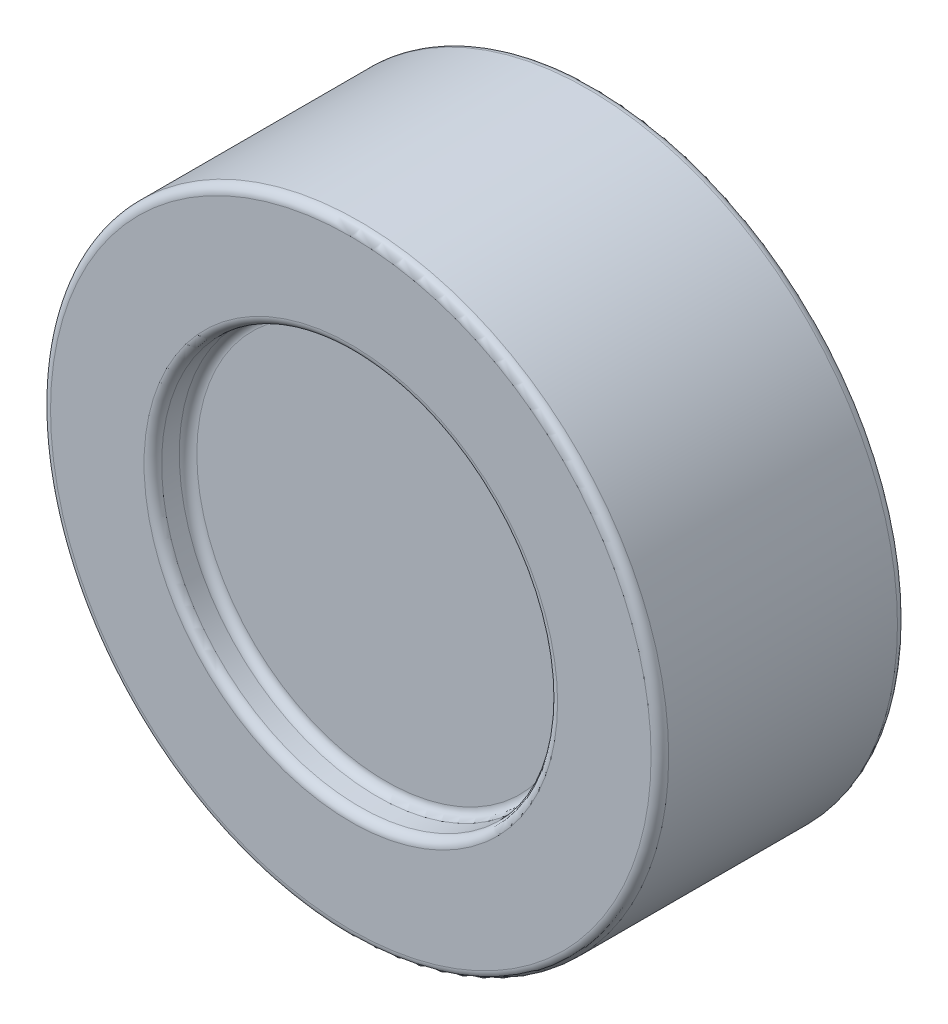
ISO-10303-21;
HEADER;
FILE_DESCRIPTION(('STEP AP214'),'2;1');
FILE_NAME('part.step','',(''),(''),'','','');
FILE_SCHEMA(('AUTOMOTIVE_DESIGN { 1 0 10303 214 1 1 1 1 }'));
ENDSEC;
DATA;
#1=APPLICATION_CONTEXT('core data for automotive mechanical design processes');
#2=APPLICATION_PROTOCOL_DEFINITION('international standard','automotive_design',2000,#1);
#3=PRODUCT_CONTEXT('',#1,'mechanical');
#4=PRODUCT('Part','Part','',(#3));
#5=PRODUCT_RELATED_PRODUCT_CATEGORY('part','',(#4));
#6=PRODUCT_DEFINITION_FORMATION('','',#4);
#7=PRODUCT_DEFINITION_CONTEXT('part definition',#1,'design');
#8=PRODUCT_DEFINITION('design','',#6,#7);
#9=PRODUCT_DEFINITION_SHAPE('','',#8);
#10=(LENGTH_UNIT() NAMED_UNIT(*) SI_UNIT(.MILLI.,.METRE.));
#11=(NAMED_UNIT(*) PLANE_ANGLE_UNIT() SI_UNIT($,.RADIAN.));
#12=(NAMED_UNIT(*) SI_UNIT($,.STERADIAN.) SOLID_ANGLE_UNIT());
#13=UNCERTAINTY_MEASURE_WITH_UNIT(LENGTH_MEASURE(1.E-05),#10,'distance_accuracy_value','');
#14=(GEOMETRIC_REPRESENTATION_CONTEXT(3) GLOBAL_UNCERTAINTY_ASSIGNED_CONTEXT((#13)) GLOBAL_UNIT_ASSIGNED_CONTEXT((#10,
#11,#12)) REPRESENTATION_CONTEXT('',''));
#15=CARTESIAN_POINT('',(0.,0.,0.));
#16=DIRECTION('',(0.,0.,1.));
#17=DIRECTION('',(1.,0.,0.));
#18=AXIS2_PLACEMENT_3D('',#15,#16,#17);
#19=CARTESIAN_POINT('',(0.,0.,24.));
#20=DIRECTION('',(0.,0.,1.));
#21=DIRECTION('',(1.,0.,0.));
#22=AXIS2_PLACEMENT_3D('',#19,#20,#21);
#23=PLANE('',#22);
#24=CARTESIAN_POINT('',(0.,0.,24.));
#25=DIRECTION('',(0.,0.,1.));
#26=DIRECTION('',(1.,0.,0.));
#27=AXIS2_PLACEMENT_3D('',#24,#25,#26);
#28=CIRCLE('',#27,21.5);
#29=CARTESIAN_POINT('',(21.5,0.,24.));
#30=VERTEX_POINT('',#29);
#31=EDGE_CURVE('E61',#30,#30,#28,.T.);
#32=ORIENTED_EDGE('',*,*,#31,.T.);
#33=EDGE_LOOP('',(#32));
#34=FACE_BOUND('',#33,.T.);
#35=ADVANCED_FACE('F43',(#34),#23,.T.);
#36=CARTESIAN_POINT('',(0.,0.,28.));
#37=DIRECTION('',(0.,0.,1.));
#38=DIRECTION('',(1.,0.,0.));
#39=AXIS2_PLACEMENT_3D('',#36,#37,#38);
#40=PLANE('',#39);
#41=CARTESIAN_POINT('',(0.,0.,28.));
#42=DIRECTION('',(0.,0.,1.));
#43=DIRECTION('',(1.,0.,0.));
#44=AXIS2_PLACEMENT_3D('',#41,#42,#43);
#45=CIRCLE('',#44,23.5);
#46=CARTESIAN_POINT('',(23.5,0.,28.));
#47=VERTEX_POINT('',#46);
#48=EDGE_CURVE('E67',#47,#47,#45,.F.);
#49=ORIENTED_EDGE('',*,*,#48,.T.);
#50=EDGE_LOOP('',(#49));
#51=FACE_BOUND('',#50,.T.);
#52=CARTESIAN_POINT('',(0.,0.,28.));
#53=DIRECTION('',(0.,0.,1.));
#54=DIRECTION('',(1.,0.,0.));
#55=AXIS2_PLACEMENT_3D('',#52,#53,#54);
#56=CIRCLE('',#55,34.125);
#57=CARTESIAN_POINT('',(34.125,0.,28.));
#58=VERTEX_POINT('',#57);
#59=EDGE_CURVE('E71',#58,#58,#56,.T.);
#60=ORIENTED_EDGE('',*,*,#59,.T.);
#61=EDGE_LOOP('',(#60));
#62=FACE_BOUND('',#61,.T.);
#63=ADVANCED_FACE('F102',(#51,#62),#40,.T.);
#64=CARTESIAN_POINT('',(0.,0.,28.));
#65=DIRECTION('',(0.,0.,-1.));
#66=DIRECTION('',(-1.,0.,0.));
#67=AXIS2_PLACEMENT_3D('',#64,#65,#66);
#68=CYLINDRICAL_SURFACE('',#67,35.125);
#69=CARTESIAN_POINT('',(0.,0.,1.));
#70=DIRECTION('',(0.,0.,1.));
#71=DIRECTION('',(1.,0.,0.));
#72=AXIS2_PLACEMENT_3D('',#69,#70,#71);
#73=CIRCLE('',#72,35.125);
#74=CARTESIAN_POINT('',(35.125,0.,1.));
#75=VERTEX_POINT('',#74);
#76=EDGE_CURVE('E51',#75,#75,#73,.T.);
#77=ORIENTED_EDGE('',*,*,#76,.T.);
#78=EDGE_LOOP('',(#77));
#79=FACE_BOUND('',#78,.T.);
#80=CARTESIAN_POINT('',(0.,0.,27.));
#81=DIRECTION('',(0.,0.,1.));
#82=DIRECTION('',(1.,0.,0.));
#83=AXIS2_PLACEMENT_3D('',#80,#81,#82);
#84=CIRCLE('',#83,35.125);
#85=CARTESIAN_POINT('',(35.125,0.,27.));
#86=VERTEX_POINT('',#85);
#87=EDGE_CURVE('E56',#86,#86,#84,.F.);
#88=ORIENTED_EDGE('',*,*,#87,.T.);
#89=EDGE_LOOP('',(#88));
#90=FACE_BOUND('',#89,.T.);
#91=ADVANCED_FACE('F108',(#79,#90),#68,.T.);
#92=CARTESIAN_POINT('',(0.,0.,28.));
#93=DIRECTION('',(0.,0.,-1.));
#94=DIRECTION('',(-1.,0.,0.));
#95=AXIS2_PLACEMENT_3D('',#92,#93,#94);
#96=CYLINDRICAL_SURFACE('',#95,22.5);
#97=CARTESIAN_POINT('',(0.,0.,27.));
#98=DIRECTION('',(0.,0.,1.));
#99=DIRECTION('',(1.,0.,0.));
#100=AXIS2_PLACEMENT_3D('',#97,#98,#99);
#101=CIRCLE('',#100,22.5);
#102=CARTESIAN_POINT('',(22.5,0.,27.));
#103=VERTEX_POINT('',#102);
#104=EDGE_CURVE('E75',#103,#103,#101,.T.);
#105=ORIENTED_EDGE('',*,*,#104,.T.);
#106=EDGE_LOOP('',(#105));
#107=FACE_BOUND('',#106,.T.);
#108=CARTESIAN_POINT('',(0.,0.,25.));
#109=DIRECTION('',(0.,0.,1.));
#110=DIRECTION('',(1.,0.,0.));
#111=AXIS2_PLACEMENT_3D('',#108,#109,#110);
#112=CIRCLE('',#111,22.5);
#113=CARTESIAN_POINT('',(22.5,0.,25.));
#114=VERTEX_POINT('',#113);
#115=EDGE_CURVE('E79',#114,#114,#112,.F.);
#116=ORIENTED_EDGE('',*,*,#115,.T.);
#117=EDGE_LOOP('',(#116));
#118=FACE_BOUND('',#117,.T.);
#119=ADVANCED_FACE('F84',(#107,#118),#96,.F.);
#120=CARTESIAN_POINT('',(0.,0.,0.));
#121=DIRECTION('',(0.,0.,1.));
#122=DIRECTION('',(1.,0.,0.));
#123=AXIS2_PLACEMENT_3D('',#120,#121,#122);
#124=PLANE('',#123);
#125=CARTESIAN_POINT('',(0.,0.,0.));
#126=DIRECTION('',(0.,0.,1.));
#127=DIRECTION('',(1.,0.,0.));
#128=AXIS2_PLACEMENT_3D('',#125,#126,#127);
#129=CIRCLE('',#128,34.125);
#130=CARTESIAN_POINT('',(34.125,0.,0.));
#131=VERTEX_POINT('',#130);
#132=EDGE_CURVE('E10',#131,#131,#129,.F.);
#133=ORIENTED_EDGE('',*,*,#132,.T.);
#134=EDGE_LOOP('',(#133));
#135=FACE_BOUND('',#134,.T.);
#136=ADVANCED_FACE('F97',(#135),#124,.F.);
#137=CARTESIAN_POINT('',(0.,0.,27.));
#138=DIRECTION('',(0.,0.,1.));
#139=DIRECTION('',(1.,0.,0.));
#140=AXIS2_PLACEMENT_3D('',#137,#138,#139);
#141=TOROIDAL_SURFACE('',#140,23.5,1.);
#142=ORIENTED_EDGE('',*,*,#48,.F.);
#143=EDGE_LOOP('',(#142));
#144=FACE_BOUND('',#143,.T.);
#145=ORIENTED_EDGE('',*,*,#104,.F.);
#146=EDGE_LOOP('',(#145));
#147=FACE_BOUND('',#146,.T.);
#148=ADVANCED_FACE('F89',(#144,#147),#141,.T.);
#149=CARTESIAN_POINT('',(0.,0.,25.));
#150=DIRECTION('',(0.,0.,1.));
#151=DIRECTION('',(1.,0.,0.));
#152=AXIS2_PLACEMENT_3D('',#149,#150,#151);
#153=TOROIDAL_SURFACE('',#152,21.5,1.);
#154=ORIENTED_EDGE('',*,*,#31,.F.);
#155=EDGE_LOOP('',(#154));
#156=FACE_BOUND('',#155,.T.);
#157=ORIENTED_EDGE('',*,*,#115,.F.);
#158=EDGE_LOOP('',(#157));
#159=FACE_BOUND('',#158,.T.);
#160=ADVANCED_FACE('F86',(#156,#159),#153,.F.);
#161=CARTESIAN_POINT('',(0.,0.,1.));
#162=DIRECTION('',(0.,0.,1.));
#163=DIRECTION('',(1.,0.,0.));
#164=AXIS2_PLACEMENT_3D('',#161,#162,#163);
#165=TOROIDAL_SURFACE('',#164,34.125,1.);
#166=ORIENTED_EDGE('',*,*,#132,.F.);
#167=EDGE_LOOP('',(#166));
#168=FACE_BOUND('',#167,.T.);
#169=ORIENTED_EDGE('',*,*,#76,.F.);
#170=EDGE_LOOP('',(#169));
#171=FACE_BOUND('',#170,.T.);
#172=ADVANCED_FACE('F88',(#168,#171),#165,.T.);
#173=CARTESIAN_POINT('',(0.,0.,27.));
#174=DIRECTION('',(0.,0.,1.));
#175=DIRECTION('',(1.,0.,0.));
#176=AXIS2_PLACEMENT_3D('',#173,#174,#175);
#177=TOROIDAL_SURFACE('',#176,34.125,1.);
#178=ORIENTED_EDGE('',*,*,#87,.F.);
#179=EDGE_LOOP('',(#178));
#180=FACE_BOUND('',#179,.T.);
#181=ORIENTED_EDGE('',*,*,#59,.F.);
#182=EDGE_LOOP('',(#181));
#183=FACE_BOUND('',#182,.T.);
#184=ADVANCED_FACE('F45',(#180,#183),#177,.T.);
#185=CLOSED_SHELL('',(#35,#63,#91,#119,#136,#148,#160,#172,#184));
#186=MANIFOLD_SOLID_BREP('B2',#185);
#187=ADVANCED_BREP_SHAPE_REPRESENTATION('',(#18,#186),#14);
#188=SHAPE_DEFINITION_REPRESENTATION(#9,#187);
ENDSEC;
END-ISO-10303-21;
